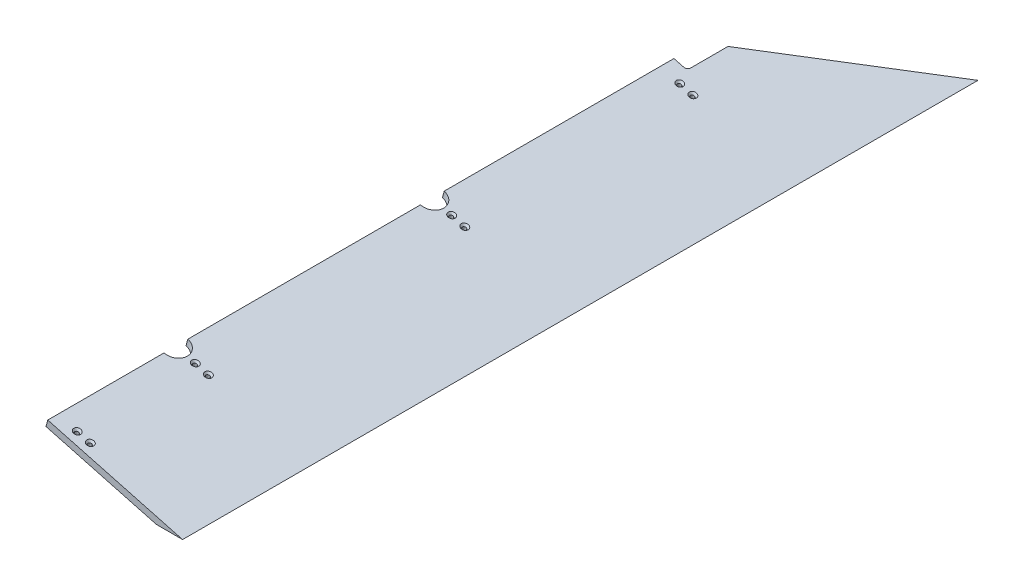
ISO-10303-21;
HEADER;
FILE_DESCRIPTION(('STEP AP214'),'2;1');
FILE_NAME('part.step','',(''),(''),'','','');
FILE_SCHEMA(('AUTOMOTIVE_DESIGN { 1 0 10303 214 1 1 1 1 }'));
ENDSEC;
DATA;
#1=APPLICATION_CONTEXT('core data for automotive mechanical design processes');
#2=APPLICATION_PROTOCOL_DEFINITION('international standard','automotive_design',2000,#1);
#3=PRODUCT_CONTEXT('',#1,'mechanical');
#4=PRODUCT('Part','Part','',(#3));
#5=PRODUCT_RELATED_PRODUCT_CATEGORY('part','',(#4));
#6=PRODUCT_DEFINITION_FORMATION('','',#4);
#7=PRODUCT_DEFINITION_CONTEXT('part definition',#1,'design');
#8=PRODUCT_DEFINITION('design','',#6,#7);
#9=PRODUCT_DEFINITION_SHAPE('','',#8);
#10=(LENGTH_UNIT() NAMED_UNIT(*) SI_UNIT(.MILLI.,.METRE.));
#11=(NAMED_UNIT(*) PLANE_ANGLE_UNIT() SI_UNIT($,.RADIAN.));
#12=(NAMED_UNIT(*) SI_UNIT($,.STERADIAN.) SOLID_ANGLE_UNIT());
#13=UNCERTAINTY_MEASURE_WITH_UNIT(LENGTH_MEASURE(1.E-05),#10,'distance_accuracy_value','');
#14=(GEOMETRIC_REPRESENTATION_CONTEXT(3) GLOBAL_UNCERTAINTY_ASSIGNED_CONTEXT((#13)) GLOBAL_UNIT_ASSIGNED_CONTEXT((#10,
#11,#12)) REPRESENTATION_CONTEXT('',''));
#15=CARTESIAN_POINT('',(0.,0.,0.));
#16=DIRECTION('',(0.,0.,1.));
#17=DIRECTION('',(1.,0.,0.));
#18=AXIS2_PLACEMENT_3D('',#15,#16,#17);
#19=CARTESIAN_POINT('',(25.512001872802,67.770934414059,1492.25));
#20=DIRECTION('',(0.965925826289068,-0.258819045102524,0.));
#21=DIRECTION('',(0.258819045102524,0.965925826289068,0.));
#22=AXIS2_PLACEMENT_3D('',#19,#20,#21);
#23=PLANE('',#22);
#24=DIRECTION('',(0.,0.,-1.));
#25=VECTOR('',#24,1.);
#26=CARTESIAN_POINT('',(25.512001872802,67.770934414059,1492.25));
#27=LINE('',#26,#25);
#28=CARTESIAN_POINT('',(25.5120018728021,67.770934414059,748.50625));
#29=VERTEX_POINT('',#28);
#30=CARTESIAN_POINT('',(25.512001872802,67.770934414059,317.5));
#31=VERTEX_POINT('',#30);
#32=EDGE_CURVE('E149',#29,#31,#27,.T.);
#33=ORIENTED_EDGE('',*,*,#32,.T.);
#34=DIRECTION('',(0.258819045102524,0.965925826289067,0.));
#35=VECTOR('',#34,1.);
#36=CARTESIAN_POINT('',(8.34908089495287,3.718041318437,317.5));
#37=LINE('',#36,#35);
#38=CARTESIAN_POINT('',(22.225,55.5036764201878,317.5));
#39=VERTEX_POINT('',#38);
#40=EDGE_CURVE('E206',#39,#31,#37,.T.);
#41=ORIENTED_EDGE('',*,*,#40,.F.);
#42=DIRECTION('',(0.,0.,-1.));
#43=VECTOR('',#42,1.);
#44=CARTESIAN_POINT('',(22.225,55.5036764201878,1492.25));
#45=LINE('',#44,#43);
#46=CARTESIAN_POINT('',(22.225,55.5036764201878,748.50625));
#47=VERTEX_POINT('',#46);
#48=EDGE_CURVE('E144',#47,#39,#45,.T.);
#49=ORIENTED_EDGE('',*,*,#48,.F.);
#50=DIRECTION('',(0.258819045102524,0.965925826289067,0.));
#51=VECTOR('',#50,1.);
#52=CARTESIAN_POINT('',(8.34908089495289,3.718041318437,748.50625));
#53=LINE('',#52,#51);
#54=EDGE_CURVE('E235',#47,#29,#53,.T.);
#55=ORIENTED_EDGE('',*,*,#54,.T.);
#56=EDGE_LOOP('',(#33,#41,#49,#55));
#57=FACE_BOUND('',#56,.T.);
#58=ADVANCED_FACE('F34',(#57),#23,.F.);
#59=CARTESIAN_POINT('',(25.5120018728021,67.770934414059,1229.51875));
#60=VERTEX_POINT('',#59);
#61=CARTESIAN_POINT('',(25.512001872802,67.770934414059,792.95625));
#62=VERTEX_POINT('',#61);
#63=EDGE_CURVE('E147',#60,#62,#27,.T.);
#64=ORIENTED_EDGE('',*,*,#63,.T.);
#65=DIRECTION('',(0.258819045102524,0.965925826289067,0.));
#66=VECTOR('',#65,1.);
#67=CARTESIAN_POINT('',(8.34908089495289,3.718041318437,792.95625));
#68=LINE('',#67,#66);
#69=CARTESIAN_POINT('',(22.225,55.5036764201878,792.95625));
#70=VERTEX_POINT('',#69);
#71=EDGE_CURVE('E232',#62,#70,#68,.F.);
#72=ORIENTED_EDGE('',*,*,#71,.T.);
#73=CARTESIAN_POINT('',(22.225,55.5036764201878,1229.51875));
#74=VERTEX_POINT('',#73);
#75=EDGE_CURVE('E156',#74,#70,#45,.T.);
#76=ORIENTED_EDGE('',*,*,#75,.F.);
#77=DIRECTION('',(0.258819045102524,0.965925826289067,0.));
#78=VECTOR('',#77,1.);
#79=CARTESIAN_POINT('',(8.34908089495289,3.718041318437,1229.51875));
#80=LINE('',#79,#78);
#81=EDGE_CURVE('E226',#74,#60,#80,.T.);
#82=ORIENTED_EDGE('',*,*,#81,.T.);
#83=EDGE_LOOP('',(#64,#72,#76,#82));
#84=FACE_BOUND('',#83,.T.);
#85=ADVANCED_FACE('F284',(#84),#23,.F.);
#86=CARTESIAN_POINT('',(25.512001872802,67.770934414059,1492.25));
#87=VERTEX_POINT('',#86);
#88=CARTESIAN_POINT('',(25.512001872802,67.770934414059,1273.96875));
#89=VERTEX_POINT('',#88);
#90=EDGE_CURVE('E142',#87,#89,#27,.T.);
#91=ORIENTED_EDGE('',*,*,#90,.T.);
#92=DIRECTION('',(0.258819045102524,0.965925826289067,0.));
#93=VECTOR('',#92,1.);
#94=CARTESIAN_POINT('',(8.34908089495289,3.718041318437,1273.96875));
#95=LINE('',#94,#93);
#96=CARTESIAN_POINT('',(22.225,55.5036764201878,1273.96875));
#97=VERTEX_POINT('',#96);
#98=EDGE_CURVE('E223',#89,#97,#95,.F.);
#99=ORIENTED_EDGE('',*,*,#98,.T.);
#100=CARTESIAN_POINT('',(22.225,55.5036764201878,1492.25));
#101=VERTEX_POINT('',#100);
#102=EDGE_CURVE('E152',#101,#97,#45,.T.);
#103=ORIENTED_EDGE('',*,*,#102,.F.);
#104=DIRECTION('',(-0.258819045102524,-0.965925826289068,0.));
#105=VECTOR('',#104,1.);
#106=CARTESIAN_POINT('',(25.512001872802,67.770934414059,1492.25));
#107=LINE('',#106,#105);
#108=EDGE_CURVE('E160',#87,#101,#107,.T.);
#109=ORIENTED_EDGE('',*,*,#108,.F.);
#110=EDGE_LOOP('',(#91,#99,#103,#109));
#111=FACE_BOUND('',#110,.T.);
#112=ADVANCED_FACE('F299',(#111),#23,.F.);
#113=CARTESIAN_POINT('',(22.225,55.5036764201878,1492.25));
#114=DIRECTION('',(0.258819045102524,0.965925826289067,0.));
#115=DIRECTION('',(-0.965925826289067,0.258819045102524,0.));
#116=AXIS2_PLACEMENT_3D('',#113,#114,#115);
#117=PLANE('',#116);
#118=CARTESIAN_POINT('',(58.5115491458709,45.7807248804393,1251.74375));
#119=DIRECTION('',(0.258819045102524,0.965925826289067,0.));
#120=DIRECTION('',(-0.965925826289067,0.258819045102524,0.));
#121=AXIS2_PLACEMENT_3D('',#118,#119,#120);
#122=CIRCLE('',#121,3.57124000000009);
#123=CARTESIAN_POINT('',(55.0619961979942,46.7050298070713,1251.74375));
#124=VERTEX_POINT('',#123);
#125=EDGE_CURVE('E192',#124,#124,#122,.T.);
#126=ORIENTED_EDGE('',*,*,#125,.T.);
#127=EDGE_LOOP('',(#126));
#128=FACE_BOUND('',#127,.T.);
#129=CARTESIAN_POINT('',(83.0460651336132,39.2067211348352,1251.74375));
#130=DIRECTION('',(0.258819045102524,0.965925826289067,0.));
#131=DIRECTION('',(-0.965925826289067,0.258819045102524,0.));
#132=AXIS2_PLACEMENT_3D('',#129,#130,#131);
#133=CIRCLE('',#132,3.57124000000009);
#134=CARTESIAN_POINT('',(79.5965121857366,40.1310260614672,1251.74375));
#135=VERTEX_POINT('',#134);
#136=EDGE_CURVE('E187',#135,#135,#133,.T.);
#137=ORIENTED_EDGE('',*,*,#136,.T.);
#138=EDGE_LOOP('',(#137));
#139=FACE_BOUND('',#138,.T.);
#140=CARTESIAN_POINT('',(58.5115491458709,45.7807248804393,770.73125));
#141=DIRECTION('',(0.258819045102524,0.965925826289067,0.));
#142=DIRECTION('',(-0.965925826289067,0.258819045102524,0.));
#143=AXIS2_PLACEMENT_3D('',#140,#141,#142);
#144=CIRCLE('',#143,3.57123999999998);
#145=CARTESIAN_POINT('',(55.0619961979943,46.7050298070713,770.73125));
#146=VERTEX_POINT('',#145);
#147=EDGE_CURVE('E182',#146,#146,#144,.T.);
#148=ORIENTED_EDGE('',*,*,#147,.T.);
#149=EDGE_LOOP('',(#148));
#150=FACE_BOUND('',#149,.T.);
#151=CARTESIAN_POINT('',(83.0460651336132,39.2067211348352,770.73125));
#152=DIRECTION('',(0.258819045102524,0.965925826289067,0.));
#153=DIRECTION('',(-0.965925826289067,0.258819045102524,0.));
#154=AXIS2_PLACEMENT_3D('',#151,#152,#153);
#155=CIRCLE('',#154,3.57123999999998);
#156=CARTESIAN_POINT('',(79.5965121857367,40.1310260614671,770.73125));
#157=VERTEX_POINT('',#156);
#158=EDGE_CURVE('E177',#157,#157,#155,.T.);
#159=ORIENTED_EDGE('',*,*,#158,.T.);
#160=EDGE_LOOP('',(#159));
#161=FACE_BOUND('',#160,.T.);
#162=CARTESIAN_POINT('',(58.5115491458709,45.7807248804393,1473.2));
#163=DIRECTION('',(0.258819045102524,0.965925826289067,0.));
#164=DIRECTION('',(-0.965925826289067,0.258819045102524,0.));
#165=AXIS2_PLACEMENT_3D('',#162,#163,#164);
#166=CIRCLE('',#165,3.57124000000009);
#167=CARTESIAN_POINT('',(55.0619961979942,46.7050298070713,1473.2));
#168=VERTEX_POINT('',#167);
#169=EDGE_CURVE('E172',#168,#168,#166,.T.);
#170=ORIENTED_EDGE('',*,*,#169,.T.);
#171=EDGE_LOOP('',(#170));
#172=FACE_BOUND('',#171,.T.);
#173=CARTESIAN_POINT('',(83.0460651336132,39.2067211348352,1473.2));
#174=DIRECTION('',(0.258819045102524,0.965925826289067,0.));
#175=DIRECTION('',(-0.965925826289067,0.258819045102524,0.));
#176=AXIS2_PLACEMENT_3D('',#173,#174,#175);
#177=CIRCLE('',#176,3.57124000000009);
#178=CARTESIAN_POINT('',(79.5965121857366,40.1310260614672,1473.2));
#179=VERTEX_POINT('',#178);
#180=EDGE_CURVE('E167',#179,#179,#177,.T.);
#181=ORIENTED_EDGE('',*,*,#180,.T.);
#182=EDGE_LOOP('',(#181));
#183=FACE_BOUND('',#182,.T.);
#184=CARTESIAN_POINT('',(58.5115491458709,45.7807248804393,342.9));
#185=DIRECTION('',(0.258819045102524,0.965925826289067,0.));
#186=DIRECTION('',(-0.965925826289067,0.258819045102524,0.));
#187=AXIS2_PLACEMENT_3D('',#184,#185,#186);
#188=CIRCLE('',#187,3.57123999999998);
#189=CARTESIAN_POINT('',(55.0619961979943,46.7050298070713,342.9));
#190=VERTEX_POINT('',#189);
#191=EDGE_CURVE('E162',#190,#190,#188,.T.);
#192=ORIENTED_EDGE('',*,*,#191,.T.);
#193=EDGE_LOOP('',(#192));
#194=FACE_BOUND('',#193,.T.);
#195=CARTESIAN_POINT('',(83.0460651336132,39.2067211348352,342.9));
#196=DIRECTION('',(0.258819045102524,0.965925826289067,0.));
#197=DIRECTION('',(-0.965925826289067,0.258819045102524,0.));
#198=AXIS2_PLACEMENT_3D('',#195,#196,#197);
#199=CIRCLE('',#198,3.57123999999998);
#200=CARTESIAN_POINT('',(79.5965121857367,40.1310260614671,342.9));
#201=VERTEX_POINT('',#200);
#202=EDGE_CURVE('E157',#201,#201,#199,.T.);
#203=ORIENTED_EDGE('',*,*,#202,.T.);
#204=EDGE_LOOP('',(#203));
#205=FACE_BOUND('',#204,.T.);
#206=DIRECTION('',(0.965925826289067,-0.258819045102524,0.));
#207=VECTOR('',#206,1.);
#208=CARTESIAN_POINT('',(22.225,55.5036764201878,317.5));
#209=LINE('',#208,#207);
#210=CARTESIAN_POINT('',(40.6258869908067,50.5731736109847,317.5));
#211=VERTEX_POINT('',#210);
#212=EDGE_CURVE('E211',#39,#211,#209,.T.);
#213=ORIENTED_EDGE('',*,*,#212,.T.);
#214=CARTESIAN_POINT('',(40.6258869908067,50.5731736109847,311.15));
#215=DIRECTION('',(0.258819045102524,0.965925826289067,0.));
#216=DIRECTION('',(-0.965925826289067,0.258819045102524,0.));
#217=AXIS2_PLACEMENT_3D('',#214,#215,#216);
#218=CIRCLE('',#217,6.35);
#219=CARTESIAN_POINT('',(46.7595159877423,48.9296726745837,311.15));
#220=VERTEX_POINT('',#219);
#221=EDGE_CURVE('E11',#211,#220,#218,.T.);
#222=ORIENTED_EDGE('',*,*,#221,.T.);
#223=DIRECTION('',(0.,0.,-1.));
#224=VECTOR('',#223,1.);
#225=CARTESIAN_POINT('',(46.7595159877423,48.9296726745837,1492.25));
#226=LINE('',#225,#224);
#227=CARTESIAN_POINT('',(46.7595159877423,48.9296726745837,240.609994719491));
#228=VERTEX_POINT('',#227);
#229=EDGE_CURVE('E137',#220,#228,#226,.T.);
#230=ORIENTED_EDGE('',*,*,#229,.T.);
#231=DIRECTION('',(0.677026360272497,-0.181408666489601,-0.71325044915418));
#232=VECTOR('',#231,1.);
#233=CARTESIAN_POINT('',(-569.697284368731,214.108774498777,890.050128130889));
#234=LINE('',#233,#232);
#235=CARTESIAN_POINT('',(229.367540407001,0.,48.2315836576664));
#236=VERTEX_POINT('',#235);
#237=EDGE_CURVE('E136',#228,#236,#234,.T.);
#238=ORIENTED_EDGE('',*,*,#237,.T.);
#239=DIRECTION('',(0.,0.,-1.));
#240=VECTOR('',#239,1.);
#241=CARTESIAN_POINT('',(229.367540407001,0.,1492.25));
#242=LINE('',#241,#240);
#243=CARTESIAN_POINT('',(229.367540407001,0.,1492.25));
#244=VERTEX_POINT('',#243);
#245=EDGE_CURVE('E135',#244,#236,#242,.T.);
#246=ORIENTED_EDGE('',*,*,#245,.F.);
#247=DIRECTION('',(0.965925826289067,-0.258819045102524,0.));
#248=VECTOR('',#247,1.);
#249=CARTESIAN_POINT('',(22.225,55.5036764201878,1492.25));
#250=LINE('',#249,#248);
#251=EDGE_CURVE('E273',#101,#244,#250,.T.);
#252=ORIENTED_EDGE('',*,*,#251,.F.);
#253=ORIENTED_EDGE('',*,*,#102,.T.);
#254=CARTESIAN_POINT('',(22.225,55.5036764201878,1251.74375));
#255=DIRECTION('',(0.258819045102524,0.965925826289067,0.));
#256=DIRECTION('',(-0.965925826289067,0.258819045102524,0.));
#257=AXIS2_PLACEMENT_3D('',#254,#255,#256);
#258=CIRCLE('',#257,22.2250000000001);
#259=EDGE_CURVE('E219',#97,#74,#258,.T.);
#260=ORIENTED_EDGE('',*,*,#259,.T.);
#261=ORIENTED_EDGE('',*,*,#75,.T.);
#262=CARTESIAN_POINT('',(22.225,55.5036764201878,770.73125));
#263=DIRECTION('',(0.258819045102524,0.965925826289067,0.));
#264=DIRECTION('',(-0.965925826289067,0.258819045102524,0.));
#265=AXIS2_PLACEMENT_3D('',#262,#263,#264);
#266=CIRCLE('',#265,22.225);
#267=EDGE_CURVE('E229',#70,#47,#266,.T.);
#268=ORIENTED_EDGE('',*,*,#267,.T.);
#269=ORIENTED_EDGE('',*,*,#48,.T.);
#270=EDGE_LOOP('',(#213,#222,#230,#238,#246,#252,#253,#260,#261,#268,#269));
#271=FACE_BOUND('',#270,.T.);
#272=ADVANCED_FACE('F294',(#128,#139,#150,#161,#172,#183,#194,#205,#271),#117,.F.);
#273=CARTESIAN_POINT('',(229.367540407001,0.,1492.25));
#274=DIRECTION('',(0.,1.,0.));
#275=DIRECTION('',(0.,0.,1.));
#276=AXIS2_PLACEMENT_3D('',#273,#274,#275);
#277=PLANE('',#276);
#278=ORIENTED_EDGE('',*,*,#245,.T.);
#279=DIRECTION('',(0.713166303643539,0.,-0.700994881113559));
#280=VECTOR('',#279,1.);
#281=CARTESIAN_POINT('',(-492.534706773972,0.,757.813314248201));
#282=LINE('',#281,#280);
#283=CARTESIAN_POINT('',(278.436572382485,0.,0.));
#284=VERTEX_POINT('',#283);
#285=EDGE_CURVE('E120',#236,#284,#282,.T.);
#286=ORIENTED_EDGE('',*,*,#285,.T.);
#287=DIRECTION('',(0.,0.,-1.));
#288=VECTOR('',#287,1.);
#289=CARTESIAN_POINT('',(278.436572382485,0.,1492.25));
#290=LINE('',#289,#288);
#291=CARTESIAN_POINT('',(278.436572382485,0.,1492.25));
#292=VERTEX_POINT('',#291);
#293=EDGE_CURVE('E132',#292,#284,#290,.T.);
#294=ORIENTED_EDGE('',*,*,#293,.F.);
#295=DIRECTION('',(1.,0.,0.));
#296=VECTOR('',#295,1.);
#297=CARTESIAN_POINT('',(229.367540407001,0.,1492.25));
#298=LINE('',#297,#296);
#299=EDGE_CURVE('E275',#244,#292,#298,.T.);
#300=ORIENTED_EDGE('',*,*,#299,.F.);
#301=EDGE_LOOP('',(#278,#286,#294,#300));
#302=FACE_BOUND('',#301,.T.);
#303=ADVANCED_FACE('F130',(#302),#277,.F.);
#304=CARTESIAN_POINT('',(278.436572382485,0.,1492.25));
#305=DIRECTION('',(-0.258819045102524,-0.965925826289068,0.));
#306=DIRECTION('',(0.965925826289068,-0.258819045102524,0.));
#307=AXIS2_PLACEMENT_3D('',#304,#305,#306);
#308=PLANE('',#307);
#309=CARTESIAN_POINT('',(61.798551018673,58.0479828743105,1251.74375));
#310=DIRECTION('',(0.258819045102524,0.965925826289068,0.));
#311=DIRECTION('',(-0.965925826289068,0.258819045102524,0.));
#312=AXIS2_PLACEMENT_3D('',#309,#310,#311);
#313=CIRCLE('',#312,6.74369999999991);
#314=CARTESIAN_POINT('',(55.2846370239275,59.7933808687684,1251.74375));
#315=VERTEX_POINT('',#314);
#316=EDGE_CURVE('E238',#315,#315,#313,.T.);
#317=ORIENTED_EDGE('',*,*,#316,.F.);
#318=EDGE_LOOP('',(#317));
#319=FACE_BOUND('',#318,.T.);
#320=CARTESIAN_POINT('',(86.3330670064153,51.4739791287064,1251.74375));
#321=DIRECTION('',(0.258819045102524,0.965925826289068,0.));
#322=DIRECTION('',(-0.965925826289068,0.258819045102524,0.));
#323=AXIS2_PLACEMENT_3D('',#320,#321,#322);
#324=CIRCLE('',#323,6.74369999999991);
#325=CARTESIAN_POINT('',(79.8191530116698,53.2193771231643,1251.74375));
#326=VERTEX_POINT('',#325);
#327=EDGE_CURVE('E195',#326,#326,#324,.T.);
#328=ORIENTED_EDGE('',*,*,#327,.F.);
#329=EDGE_LOOP('',(#328));
#330=FACE_BOUND('',#329,.T.);
#331=CARTESIAN_POINT('',(61.798551018673,58.0479828743105,770.73125));
#332=DIRECTION('',(0.258819045102524,0.965925826289068,0.));
#333=DIRECTION('',(-0.965925826289068,0.258819045102524,0.));
#334=AXIS2_PLACEMENT_3D('',#331,#332,#333);
#335=CIRCLE('',#334,6.74370000000002);
#336=CARTESIAN_POINT('',(55.2846370239274,59.7933808687684,770.73125));
#337=VERTEX_POINT('',#336);
#338=EDGE_CURVE('E190',#337,#337,#335,.T.);
#339=ORIENTED_EDGE('',*,*,#338,.F.);
#340=EDGE_LOOP('',(#339));
#341=FACE_BOUND('',#340,.T.);
#342=CARTESIAN_POINT('',(86.3330670064153,51.4739791287064,770.73125));
#343=DIRECTION('',(0.258819045102524,0.965925826289068,0.));
#344=DIRECTION('',(-0.965925826289068,0.258819045102524,0.));
#345=AXIS2_PLACEMENT_3D('',#342,#343,#344);
#346=CIRCLE('',#345,6.74370000000002);
#347=CARTESIAN_POINT('',(79.8191530116697,53.2193771231643,770.73125));
#348=VERTEX_POINT('',#347);
#349=EDGE_CURVE('E185',#348,#348,#346,.T.);
#350=ORIENTED_EDGE('',*,*,#349,.F.);
#351=EDGE_LOOP('',(#350));
#352=FACE_BOUND('',#351,.T.);
#353=CARTESIAN_POINT('',(61.798551018673,58.0479828743105,1473.2));
#354=DIRECTION('',(0.258819045102524,0.965925826289068,0.));
#355=DIRECTION('',(-0.965925826289068,0.258819045102524,0.));
#356=AXIS2_PLACEMENT_3D('',#353,#354,#355);
#357=CIRCLE('',#356,6.74369999999991);
#358=CARTESIAN_POINT('',(55.2846370239275,59.7933808687684,1473.2));
#359=VERTEX_POINT('',#358);
#360=EDGE_CURVE('E180',#359,#359,#357,.T.);
#361=ORIENTED_EDGE('',*,*,#360,.F.);
#362=EDGE_LOOP('',(#361));
#363=FACE_BOUND('',#362,.T.);
#364=CARTESIAN_POINT('',(86.3330670064153,51.4739791287064,1473.2));
#365=DIRECTION('',(0.258819045102524,0.965925826289068,0.));
#366=DIRECTION('',(-0.965925826289068,0.258819045102524,0.));
#367=AXIS2_PLACEMENT_3D('',#364,#365,#366);
#368=CIRCLE('',#367,6.74369999999991);
#369=CARTESIAN_POINT('',(79.8191530116698,53.2193771231643,1473.2));
#370=VERTEX_POINT('',#369);
#371=EDGE_CURVE('E175',#370,#370,#368,.T.);
#372=ORIENTED_EDGE('',*,*,#371,.F.);
#373=EDGE_LOOP('',(#372));
#374=FACE_BOUND('',#373,.T.);
#375=CARTESIAN_POINT('',(61.798551018673,58.0479828743105,342.9));
#376=DIRECTION('',(0.258819045102524,0.965925826289068,0.));
#377=DIRECTION('',(-0.965925826289068,0.258819045102524,0.));
#378=AXIS2_PLACEMENT_3D('',#375,#376,#377);
#379=CIRCLE('',#378,6.74370000000002);
#380=CARTESIAN_POINT('',(55.2846370239274,59.7933808687684,342.9));
#381=VERTEX_POINT('',#380);
#382=EDGE_CURVE('E170',#381,#381,#379,.T.);
#383=ORIENTED_EDGE('',*,*,#382,.F.);
#384=EDGE_LOOP('',(#383));
#385=FACE_BOUND('',#384,.T.);
#386=CARTESIAN_POINT('',(86.3330670064153,51.4739791287064,342.9));
#387=DIRECTION('',(0.258819045102524,0.965925826289068,0.));
#388=DIRECTION('',(-0.965925826289068,0.258819045102524,0.));
#389=AXIS2_PLACEMENT_3D('',#386,#387,#388);
#390=CIRCLE('',#389,6.74370000000002);
#391=CARTESIAN_POINT('',(79.8191530116697,53.2193771231643,342.9));
#392=VERTEX_POINT('',#391);
#393=EDGE_CURVE('E165',#392,#392,#390,.T.);
#394=ORIENTED_EDGE('',*,*,#393,.F.);
#395=EDGE_LOOP('',(#394));
#396=FACE_BOUND('',#395,.T.);
#397=ORIENTED_EDGE('',*,*,#293,.T.);
#398=DIRECTION('',(0.677026360272497,-0.1814086664896,-0.71325044915418));
#399=VECTOR('',#398,1.);
#400=CARTESIAN_POINT('',(50.0465178605444,61.1969306684549,240.609994719491));
#401=LINE('',#400,#399);
#402=CARTESIAN_POINT('',(50.0465178605444,61.1969306684549,240.609994719491));
#403=VERTEX_POINT('',#402);
#404=EDGE_CURVE('E116',#403,#284,#401,.T.);
#405=ORIENTED_EDGE('',*,*,#404,.F.);
#406=DIRECTION('',(0.,0.,-1.));
#407=VECTOR('',#406,1.);
#408=CARTESIAN_POINT('',(50.0465178605444,61.1969306684549,317.5));
#409=LINE('',#408,#407);
#410=CARTESIAN_POINT('',(50.0465178605444,61.1969306684549,311.15));
#411=VERTEX_POINT('',#410);
#412=EDGE_CURVE('E203',#411,#403,#409,.T.);
#413=ORIENTED_EDGE('',*,*,#412,.F.);
#414=CARTESIAN_POINT('',(43.9128888636088,62.8404316048559,311.15));
#415=DIRECTION('',(-0.258819045102524,-0.965925826289068,0.));
#416=DIRECTION('',(0.965925826289068,-0.258819045102524,0.));
#417=AXIS2_PLACEMENT_3D('',#414,#415,#416);
#418=CIRCLE('',#417,6.35);
#419=CARTESIAN_POINT('',(43.9128888636088,62.8404316048559,317.5));
#420=VERTEX_POINT('',#419);
#421=EDGE_CURVE('E42',#411,#420,#418,.T.);
#422=ORIENTED_EDGE('',*,*,#421,.T.);
#423=DIRECTION('',(0.965925826289067,-0.258819045102524,0.));
#424=VECTOR('',#423,1.);
#425=CARTESIAN_POINT('',(25.5120018728021,67.770934414059,317.5));
#426=LINE('',#425,#424);
#427=EDGE_CURVE('E125',#31,#420,#426,.T.);
#428=ORIENTED_EDGE('',*,*,#427,.F.);
#429=ORIENTED_EDGE('',*,*,#32,.F.);
#430=CARTESIAN_POINT('',(25.5120018728021,67.770934414059,770.73125));
#431=DIRECTION('',(0.258819045102524,0.965925826289068,0.));
#432=DIRECTION('',(-0.965925826289068,0.258819045102524,0.));
#433=AXIS2_PLACEMENT_3D('',#430,#431,#432);
#434=CIRCLE('',#433,22.225);
#435=EDGE_CURVE('E217',#62,#29,#434,.T.);
#436=ORIENTED_EDGE('',*,*,#435,.F.);
#437=ORIENTED_EDGE('',*,*,#63,.F.);
#438=CARTESIAN_POINT('',(25.5120018728021,67.770934414059,1251.74375));
#439=DIRECTION('',(0.258819045102524,0.965925826289068,0.));
#440=DIRECTION('',(-0.965925826289068,0.258819045102524,0.));
#441=AXIS2_PLACEMENT_3D('',#438,#439,#440);
#442=CIRCLE('',#441,22.2250000000001);
#443=EDGE_CURVE('E216',#89,#60,#442,.T.);
#444=ORIENTED_EDGE('',*,*,#443,.F.);
#445=ORIENTED_EDGE('',*,*,#90,.F.);
#446=DIRECTION('',(-0.965925826289068,0.258819045102524,0.));
#447=VECTOR('',#446,1.);
#448=CARTESIAN_POINT('',(278.436572382485,0.,1492.25));
#449=LINE('',#448,#447);
#450=EDGE_CURVE('E141',#292,#87,#449,.T.);
#451=ORIENTED_EDGE('',*,*,#450,.F.);
#452=EDGE_LOOP('',(#397,#405,#413,#422,#428,#429,#436,#437,#444,#445,#451));
#453=FACE_BOUND('',#452,.T.);
#454=ADVANCED_FACE('F139',(#319,#330,#341,#352,#363,#374,#385,#396,#453),#308,.F.);
#455=CARTESIAN_POINT('',(0.,0.,1492.25));
#456=DIRECTION('',(0.,0.,1.));
#457=DIRECTION('',(1.,0.,0.));
#458=AXIS2_PLACEMENT_3D('',#455,#456,#457);
#459=PLANE('',#458);
#460=ORIENTED_EDGE('',*,*,#108,.T.);
#461=ORIENTED_EDGE('',*,*,#251,.T.);
#462=ORIENTED_EDGE('',*,*,#299,.T.);
#463=ORIENTED_EDGE('',*,*,#450,.T.);
#464=EDGE_LOOP('',(#460,#461,#462,#463));
#465=FACE_BOUND('',#464,.T.);
#466=ADVANCED_FACE('F301',(#465),#459,.T.);
#467=CARTESIAN_POINT('',(86.3330670064153,51.4739791287064,342.9));
#468=DIRECTION('',(0.258819045102524,0.965925826289068,0.));
#469=DIRECTION('',(-0.965925826289068,0.258819045102524,0.));
#470=AXIS2_PLACEMENT_3D('',#467,#468,#469);
#471=CYLINDRICAL_SURFACE('',#470,3.57123999999998);
#472=CARTESIAN_POINT('',(85.3885074818001,47.9488349920696,342.9));
#473=DIRECTION('',(0.258819045102524,0.965925826289068,0.));
#474=DIRECTION('',(-0.965925826289068,0.258819045102524,0.));
#475=AXIS2_PLACEMENT_3D('',#472,#473,#474);
#476=CIRCLE('',#475,3.57123999999998);
#477=CARTESIAN_POINT('',(81.9389545339236,48.8731399187015,342.9));
#478=VERTEX_POINT('',#477);
#479=EDGE_CURVE('E161',#478,#478,#476,.T.);
#480=ORIENTED_EDGE('',*,*,#479,.T.);
#481=EDGE_LOOP('',(#480));
#482=FACE_BOUND('',#481,.T.);
#483=ORIENTED_EDGE('',*,*,#202,.F.);
#484=EDGE_LOOP('',(#483));
#485=FACE_BOUND('',#484,.T.);
#486=ADVANCED_FACE('F329',(#482,#485),#471,.F.);
#487=CARTESIAN_POINT('',(86.3330670064153,51.4739791287064,342.9));
#488=DIRECTION('',(0.258819045102524,0.965925826289068,0.));
#489=DIRECTION('',(-0.965925826289068,0.258819045102524,0.));
#490=AXIS2_PLACEMENT_3D('',#487,#488,#489);
#491=CONICAL_SURFACE('',#490,6.74370000000002,0.715584993317682);
#492=ORIENTED_EDGE('',*,*,#479,.F.);
#493=EDGE_LOOP('',(#492));
#494=FACE_BOUND('',#493,.T.);
#495=ORIENTED_EDGE('',*,*,#393,.T.);
#496=EDGE_LOOP('',(#495));
#497=FACE_BOUND('',#496,.T.);
#498=ADVANCED_FACE('F332',(#494,#497),#491,.F.);
#499=CARTESIAN_POINT('',(61.798551018673,58.0479828743105,342.9));
#500=DIRECTION('',(0.258819045102524,0.965925826289068,0.));
#501=DIRECTION('',(-0.965925826289068,0.258819045102524,0.));
#502=AXIS2_PLACEMENT_3D('',#499,#500,#501);
#503=CYLINDRICAL_SURFACE('',#502,3.57123999999998);
#504=CARTESIAN_POINT('',(60.8539914940578,54.5228387376737,342.9));
#505=DIRECTION('',(0.258819045102524,0.965925826289068,0.));
#506=DIRECTION('',(-0.965925826289068,0.258819045102524,0.));
#507=AXIS2_PLACEMENT_3D('',#504,#505,#506);
#508=CIRCLE('',#507,3.57123999999998);
#509=CARTESIAN_POINT('',(57.4044385461813,55.4471436643057,342.9));
#510=VERTEX_POINT('',#509);
#511=EDGE_CURVE('E166',#510,#510,#508,.T.);
#512=ORIENTED_EDGE('',*,*,#511,.T.);
#513=EDGE_LOOP('',(#512));
#514=FACE_BOUND('',#513,.T.);
#515=ORIENTED_EDGE('',*,*,#191,.F.);
#516=EDGE_LOOP('',(#515));
#517=FACE_BOUND('',#516,.T.);
#518=ADVANCED_FACE('F336',(#514,#517),#503,.F.);
#519=CARTESIAN_POINT('',(61.798551018673,58.0479828743105,342.9));
#520=DIRECTION('',(0.258819045102524,0.965925826289068,0.));
#521=DIRECTION('',(-0.965925826289068,0.258819045102524,0.));
#522=AXIS2_PLACEMENT_3D('',#519,#520,#521);
#523=CONICAL_SURFACE('',#522,6.74370000000002,0.715584993317682);
#524=ORIENTED_EDGE('',*,*,#511,.F.);
#525=EDGE_LOOP('',(#524));
#526=FACE_BOUND('',#525,.T.);
#527=ORIENTED_EDGE('',*,*,#382,.T.);
#528=EDGE_LOOP('',(#527));
#529=FACE_BOUND('',#528,.T.);
#530=ADVANCED_FACE('F340',(#526,#529),#523,.F.);
#531=CARTESIAN_POINT('',(86.3330670064153,51.4739791287064,1473.2));
#532=DIRECTION('',(0.258819045102524,0.965925826289068,0.));
#533=DIRECTION('',(-0.965925826289068,0.258819045102524,0.));
#534=AXIS2_PLACEMENT_3D('',#531,#532,#533);
#535=CYLINDRICAL_SURFACE('',#534,3.57124000000009);
#536=CARTESIAN_POINT('',(85.3885074818001,47.9488349920696,1473.2));
#537=DIRECTION('',(0.258819045102524,0.965925826289068,0.));
#538=DIRECTION('',(-0.965925826289068,0.258819045102524,0.));
#539=AXIS2_PLACEMENT_3D('',#536,#537,#538);
#540=CIRCLE('',#539,3.57124000000009);
#541=CARTESIAN_POINT('',(81.9389545339235,48.8731399187016,1473.2));
#542=VERTEX_POINT('',#541);
#543=EDGE_CURVE('E171',#542,#542,#540,.T.);
#544=ORIENTED_EDGE('',*,*,#543,.T.);
#545=EDGE_LOOP('',(#544));
#546=FACE_BOUND('',#545,.T.);
#547=ORIENTED_EDGE('',*,*,#180,.F.);
#548=EDGE_LOOP('',(#547));
#549=FACE_BOUND('',#548,.T.);
#550=ADVANCED_FACE('F344',(#546,#549),#535,.F.);
#551=CARTESIAN_POINT('',(86.3330670064153,51.4739791287064,1473.2));
#552=DIRECTION('',(0.258819045102524,0.965925826289068,0.));
#553=DIRECTION('',(-0.965925826289068,0.258819045102524,0.));
#554=AXIS2_PLACEMENT_3D('',#551,#552,#553);
#555=CONICAL_SURFACE('',#554,6.74369999999991,0.715584993317647);
#556=ORIENTED_EDGE('',*,*,#543,.F.);
#557=EDGE_LOOP('',(#556));
#558=FACE_BOUND('',#557,.T.);
#559=ORIENTED_EDGE('',*,*,#371,.T.);
#560=EDGE_LOOP('',(#559));
#561=FACE_BOUND('',#560,.T.);
#562=ADVANCED_FACE('F348',(#558,#561),#555,.F.);
#563=CARTESIAN_POINT('',(61.798551018673,58.0479828743105,1473.2));
#564=DIRECTION('',(0.258819045102524,0.965925826289068,0.));
#565=DIRECTION('',(-0.965925826289068,0.258819045102524,0.));
#566=AXIS2_PLACEMENT_3D('',#563,#564,#565);
#567=CYLINDRICAL_SURFACE('',#566,3.57124000000009);
#568=CARTESIAN_POINT('',(60.8539914940578,54.5228387376737,1473.2));
#569=DIRECTION('',(0.258819045102524,0.965925826289068,0.));
#570=DIRECTION('',(-0.965925826289068,0.258819045102524,0.));
#571=AXIS2_PLACEMENT_3D('',#568,#569,#570);
#572=CIRCLE('',#571,3.57124000000009);
#573=CARTESIAN_POINT('',(57.4044385461811,55.4471436643057,1473.2));
#574=VERTEX_POINT('',#573);
#575=EDGE_CURVE('E176',#574,#574,#572,.T.);
#576=ORIENTED_EDGE('',*,*,#575,.T.);
#577=EDGE_LOOP('',(#576));
#578=FACE_BOUND('',#577,.T.);
#579=ORIENTED_EDGE('',*,*,#169,.F.);
#580=EDGE_LOOP('',(#579));
#581=FACE_BOUND('',#580,.T.);
#582=ADVANCED_FACE('F352',(#578,#581),#567,.F.);
#583=CARTESIAN_POINT('',(61.798551018673,58.0479828743105,1473.2));
#584=DIRECTION('',(0.258819045102524,0.965925826289068,0.));
#585=DIRECTION('',(-0.965925826289068,0.258819045102524,0.));
#586=AXIS2_PLACEMENT_3D('',#583,#584,#585);
#587=CONICAL_SURFACE('',#586,6.74369999999991,0.715584993317647);
#588=ORIENTED_EDGE('',*,*,#575,.F.);
#589=EDGE_LOOP('',(#588));
#590=FACE_BOUND('',#589,.T.);
#591=ORIENTED_EDGE('',*,*,#360,.T.);
#592=EDGE_LOOP('',(#591));
#593=FACE_BOUND('',#592,.T.);
#594=ADVANCED_FACE('F356',(#590,#593),#587,.F.);
#595=CARTESIAN_POINT('',(86.3330670064153,51.4739791287064,770.73125));
#596=DIRECTION('',(0.258819045102524,0.965925826289068,0.));
#597=DIRECTION('',(-0.965925826289068,0.258819045102524,0.));
#598=AXIS2_PLACEMENT_3D('',#595,#596,#597);
#599=CYLINDRICAL_SURFACE('',#598,3.57123999999998);
#600=CARTESIAN_POINT('',(85.3885074818001,47.9488349920696,770.73125));
#601=DIRECTION('',(0.258819045102524,0.965925826289068,0.));
#602=DIRECTION('',(-0.965925826289068,0.258819045102524,0.));
#603=AXIS2_PLACEMENT_3D('',#600,#601,#602);
#604=CIRCLE('',#603,3.57123999999998);
#605=CARTESIAN_POINT('',(81.9389545339236,48.8731399187015,770.73125));
#606=VERTEX_POINT('',#605);
#607=EDGE_CURVE('E181',#606,#606,#604,.T.);
#608=ORIENTED_EDGE('',*,*,#607,.T.);
#609=EDGE_LOOP('',(#608));
#610=FACE_BOUND('',#609,.T.);
#611=ORIENTED_EDGE('',*,*,#158,.F.);
#612=EDGE_LOOP('',(#611));
#613=FACE_BOUND('',#612,.T.);
#614=ADVANCED_FACE('F360',(#610,#613),#599,.F.);
#615=CARTESIAN_POINT('',(86.3330670064153,51.4739791287064,770.73125));
#616=DIRECTION('',(0.258819045102524,0.965925826289068,0.));
#617=DIRECTION('',(-0.965925826289068,0.258819045102524,0.));
#618=AXIS2_PLACEMENT_3D('',#615,#616,#617);
#619=CONICAL_SURFACE('',#618,6.74370000000002,0.715584993317682);
#620=ORIENTED_EDGE('',*,*,#607,.F.);
#621=EDGE_LOOP('',(#620));
#622=FACE_BOUND('',#621,.T.);
#623=ORIENTED_EDGE('',*,*,#349,.T.);
#624=EDGE_LOOP('',(#623));
#625=FACE_BOUND('',#624,.T.);
#626=ADVANCED_FACE('F364',(#622,#625),#619,.F.);
#627=CARTESIAN_POINT('',(61.798551018673,58.0479828743105,770.73125));
#628=DIRECTION('',(0.258819045102524,0.965925826289068,0.));
#629=DIRECTION('',(-0.965925826289068,0.258819045102524,0.));
#630=AXIS2_PLACEMENT_3D('',#627,#628,#629);
#631=CYLINDRICAL_SURFACE('',#630,3.57123999999998);
#632=CARTESIAN_POINT('',(60.8539914940578,54.5228387376737,770.73125));
#633=DIRECTION('',(0.258819045102524,0.965925826289068,0.));
#634=DIRECTION('',(-0.965925826289068,0.258819045102524,0.));
#635=AXIS2_PLACEMENT_3D('',#632,#633,#634);
#636=CIRCLE('',#635,3.57123999999998);
#637=CARTESIAN_POINT('',(57.4044385461813,55.4471436643057,770.73125));
#638=VERTEX_POINT('',#637);
#639=EDGE_CURVE('E186',#638,#638,#636,.T.);
#640=ORIENTED_EDGE('',*,*,#639,.T.);
#641=EDGE_LOOP('',(#640));
#642=FACE_BOUND('',#641,.T.);
#643=ORIENTED_EDGE('',*,*,#147,.F.);
#644=EDGE_LOOP('',(#643));
#645=FACE_BOUND('',#644,.T.);
#646=ADVANCED_FACE('F368',(#642,#645),#631,.F.);
#647=CARTESIAN_POINT('',(61.798551018673,58.0479828743105,770.73125));
#648=DIRECTION('',(0.258819045102524,0.965925826289068,0.));
#649=DIRECTION('',(-0.965925826289068,0.258819045102524,0.));
#650=AXIS2_PLACEMENT_3D('',#647,#648,#649);
#651=CONICAL_SURFACE('',#650,6.74370000000002,0.715584993317682);
#652=ORIENTED_EDGE('',*,*,#639,.F.);
#653=EDGE_LOOP('',(#652));
#654=FACE_BOUND('',#653,.T.);
#655=ORIENTED_EDGE('',*,*,#338,.T.);
#656=EDGE_LOOP('',(#655));
#657=FACE_BOUND('',#656,.T.);
#658=ADVANCED_FACE('F372',(#654,#657),#651,.F.);
#659=CARTESIAN_POINT('',(86.3330670064153,51.4739791287064,1251.74375));
#660=DIRECTION('',(0.258819045102524,0.965925826289068,0.));
#661=DIRECTION('',(-0.965925826289068,0.258819045102524,0.));
#662=AXIS2_PLACEMENT_3D('',#659,#660,#661);
#663=CYLINDRICAL_SURFACE('',#662,3.57124000000009);
#664=CARTESIAN_POINT('',(85.3885074818001,47.9488349920696,1251.74375));
#665=DIRECTION('',(0.258819045102524,0.965925826289068,0.));
#666=DIRECTION('',(-0.965925826289068,0.258819045102524,0.));
#667=AXIS2_PLACEMENT_3D('',#664,#665,#666);
#668=CIRCLE('',#667,3.57124000000009);
#669=CARTESIAN_POINT('',(81.9389545339235,48.8731399187016,1251.74375));
#670=VERTEX_POINT('',#669);
#671=EDGE_CURVE('E191',#670,#670,#668,.T.);
#672=ORIENTED_EDGE('',*,*,#671,.T.);
#673=EDGE_LOOP('',(#672));
#674=FACE_BOUND('',#673,.T.);
#675=ORIENTED_EDGE('',*,*,#136,.F.);
#676=EDGE_LOOP('',(#675));
#677=FACE_BOUND('',#676,.T.);
#678=ADVANCED_FACE('F376',(#674,#677),#663,.F.);
#679=CARTESIAN_POINT('',(86.3330670064153,51.4739791287064,1251.74375));
#680=DIRECTION('',(0.258819045102524,0.965925826289068,0.));
#681=DIRECTION('',(-0.965925826289068,0.258819045102524,0.));
#682=AXIS2_PLACEMENT_3D('',#679,#680,#681);
#683=CONICAL_SURFACE('',#682,6.74369999999991,0.715584993317647);
#684=ORIENTED_EDGE('',*,*,#671,.F.);
#685=EDGE_LOOP('',(#684));
#686=FACE_BOUND('',#685,.T.);
#687=ORIENTED_EDGE('',*,*,#327,.T.);
#688=EDGE_LOOP('',(#687));
#689=FACE_BOUND('',#688,.T.);
#690=ADVANCED_FACE('F380',(#686,#689),#683,.F.);
#691=CARTESIAN_POINT('',(61.798551018673,58.0479828743105,1251.74375));
#692=DIRECTION('',(0.258819045102524,0.965925826289068,0.));
#693=DIRECTION('',(-0.965925826289068,0.258819045102524,0.));
#694=AXIS2_PLACEMENT_3D('',#691,#692,#693);
#695=CYLINDRICAL_SURFACE('',#694,3.57124000000009);
#696=CARTESIAN_POINT('',(60.8539914940578,54.5228387376737,1251.74375));
#697=DIRECTION('',(0.258819045102524,0.965925826289068,0.));
#698=DIRECTION('',(-0.965925826289068,0.258819045102524,0.));
#699=AXIS2_PLACEMENT_3D('',#696,#697,#698);
#700=CIRCLE('',#699,3.57124000000009);
#701=CARTESIAN_POINT('',(57.4044385461811,55.4471436643057,1251.74375));
#702=VERTEX_POINT('',#701);
#703=EDGE_CURVE('E196',#702,#702,#700,.T.);
#704=ORIENTED_EDGE('',*,*,#703,.T.);
#705=EDGE_LOOP('',(#704));
#706=FACE_BOUND('',#705,.T.);
#707=ORIENTED_EDGE('',*,*,#125,.F.);
#708=EDGE_LOOP('',(#707));
#709=FACE_BOUND('',#708,.T.);
#710=ADVANCED_FACE('F384',(#706,#709),#695,.F.);
#711=CARTESIAN_POINT('',(61.798551018673,58.0479828743105,1251.74375));
#712=DIRECTION('',(0.258819045102524,0.965925826289068,0.));
#713=DIRECTION('',(-0.965925826289068,0.258819045102524,0.));
#714=AXIS2_PLACEMENT_3D('',#711,#712,#713);
#715=CONICAL_SURFACE('',#714,6.74369999999991,0.715584993317647);
#716=ORIENTED_EDGE('',*,*,#703,.F.);
#717=EDGE_LOOP('',(#716));
#718=FACE_BOUND('',#717,.T.);
#719=ORIENTED_EDGE('',*,*,#316,.T.);
#720=EDGE_LOOP('',(#719));
#721=FACE_BOUND('',#720,.T.);
#722=ADVANCED_FACE('F388',(#718,#721),#715,.F.);
#723=CARTESIAN_POINT('',(8.34908089495287,3.718041318437,1251.74375));
#724=DIRECTION('',(0.258819045102524,0.965925826289067,0.));
#725=DIRECTION('',(-0.965925826289068,0.258819045102524,0.));
#726=AXIS2_PLACEMENT_3D('',#723,#724,#725);
#727=CYLINDRICAL_SURFACE('',#726,22.2250000000001);
#728=ORIENTED_EDGE('',*,*,#259,.F.);
#729=ORIENTED_EDGE('',*,*,#98,.F.);
#730=ORIENTED_EDGE('',*,*,#443,.T.);
#731=ORIENTED_EDGE('',*,*,#81,.F.);
#732=EDGE_LOOP('',(#728,#729,#730,#731));
#733=FACE_BOUND('',#732,.T.);
#734=ADVANCED_FACE('F297',(#733),#727,.F.);
#735=CARTESIAN_POINT('',(8.34908089495287,3.718041318437,770.73125));
#736=DIRECTION('',(0.258819045102524,0.965925826289067,0.));
#737=DIRECTION('',(-0.965925826289068,0.258819045102524,0.));
#738=AXIS2_PLACEMENT_3D('',#735,#736,#737);
#739=CYLINDRICAL_SURFACE('',#738,22.225);
#740=ORIENTED_EDGE('',*,*,#267,.F.);
#741=ORIENTED_EDGE('',*,*,#71,.F.);
#742=ORIENTED_EDGE('',*,*,#435,.T.);
#743=ORIENTED_EDGE('',*,*,#54,.F.);
#744=EDGE_LOOP('',(#740,#741,#742,#743));
#745=FACE_BOUND('',#744,.T.);
#746=ADVANCED_FACE('F290',(#745),#739,.F.);
#747=CARTESIAN_POINT('',(32.8835968826952,-2.85596242716711,240.609994719491));
#748=DIRECTION('',(0.6889470294503,-0.184602800169031,0.700909264299852));
#749=DIRECTION('',(0.713166303643539,0.,-0.700994881113559));
#750=AXIS2_PLACEMENT_3D('',#747,#748,#749);
#751=PLANE('',#750);
#752=DIRECTION('',(0.258819045102524,0.965925826289067,0.));
#753=VECTOR('',#752,1.);
#754=CARTESIAN_POINT('',(32.8835968826952,-2.85596242716711,240.609994719491));
#755=LINE('',#754,#753);
#756=EDGE_CURVE('E123',#228,#403,#755,.T.);
#757=ORIENTED_EDGE('',*,*,#756,.T.);
#758=ORIENTED_EDGE('',*,*,#404,.T.);
#759=ORIENTED_EDGE('',*,*,#285,.F.);
#760=ORIENTED_EDGE('',*,*,#237,.F.);
#761=EDGE_LOOP('',(#757,#758,#759,#760));
#762=FACE_BOUND('',#761,.T.);
#763=ADVANCED_FACE('F118',(#762),#751,.F.);
#764=CARTESIAN_POINT('',(32.8835968826952,-2.85596242716711,317.5));
#765=DIRECTION('',(0.965925826289067,-0.258819045102524,0.));
#766=DIRECTION('',(0.258819045102524,0.965925826289068,0.));
#767=AXIS2_PLACEMENT_3D('',#764,#765,#766);
#768=PLANE('',#767);
#769=ORIENTED_EDGE('',*,*,#229,.F.);
#770=DIRECTION('',(0.258819045102524,0.965925826289068,0.));
#771=VECTOR('',#770,1.);
#772=CARTESIAN_POINT('',(50.0465178605444,61.1969306684549,311.15));
#773=LINE('',#772,#771);
#774=EDGE_CURVE('E155',#220,#411,#773,.T.);
#775=ORIENTED_EDGE('',*,*,#774,.T.);
#776=ORIENTED_EDGE('',*,*,#412,.T.);
#777=ORIENTED_EDGE('',*,*,#756,.F.);
#778=EDGE_LOOP('',(#769,#775,#776,#777));
#779=FACE_BOUND('',#778,.T.);
#780=ADVANCED_FACE('F202',(#779),#768,.F.);
#781=CARTESIAN_POINT('',(8.34908089495287,3.718041318437,317.5));
#782=DIRECTION('',(0.,0.,1.));
#783=DIRECTION('',(1.,0.,0.));
#784=AXIS2_PLACEMENT_3D('',#781,#782,#783);
#785=PLANE('',#784);
#786=ORIENTED_EDGE('',*,*,#427,.T.);
#787=DIRECTION('',(0.258819045102524,0.965925826289068,0.));
#788=VECTOR('',#787,1.);
#789=CARTESIAN_POINT('',(40.6258869908067,50.5731736109847,317.5));
#790=LINE('',#789,#788);
#791=EDGE_CURVE('E49',#420,#211,#790,.F.);
#792=ORIENTED_EDGE('',*,*,#791,.T.);
#793=ORIENTED_EDGE('',*,*,#212,.F.);
#794=ORIENTED_EDGE('',*,*,#40,.T.);
#795=EDGE_LOOP('',(#786,#792,#793,#794));
#796=FACE_BOUND('',#795,.T.);
#797=ADVANCED_FACE('F303',(#796),#785,.F.);
#798=CARTESIAN_POINT('',(26.7499678857596,-1.21246149076608,311.15));
#799=DIRECTION('',(-0.258819045102524,-0.965925826289068,0.));
#800=DIRECTION('',(0.965925826289068,-0.258819045102524,0.));
#801=AXIS2_PLACEMENT_3D('',#798,#799,#800);
#802=CYLINDRICAL_SURFACE('',#801,6.35);
#803=ORIENTED_EDGE('',*,*,#221,.F.);
#804=ORIENTED_EDGE('',*,*,#791,.F.);
#805=ORIENTED_EDGE('',*,*,#421,.F.);
#806=ORIENTED_EDGE('',*,*,#774,.F.);
#807=EDGE_LOOP('',(#803,#804,#805,#806));
#808=FACE_BOUND('',#807,.T.);
#809=ADVANCED_FACE('F36',(#808),#802,.F.);
#810=CLOSED_SHELL('',(#58,#85,#112,#272,#303,#454,#466,#486,#498,#518,#530,#550,#562,#582,#594,
#614,#626,#646,#658,#678,#690,#710,#722,#734,#746,#763,#780,#797,#809));
#811=MANIFOLD_SOLID_BREP('B2',#810);
#812=ADVANCED_BREP_SHAPE_REPRESENTATION('',(#18,#811),#14);
#813=SHAPE_DEFINITION_REPRESENTATION(#9,#812);
ENDSEC;
END-ISO-10303-21;
